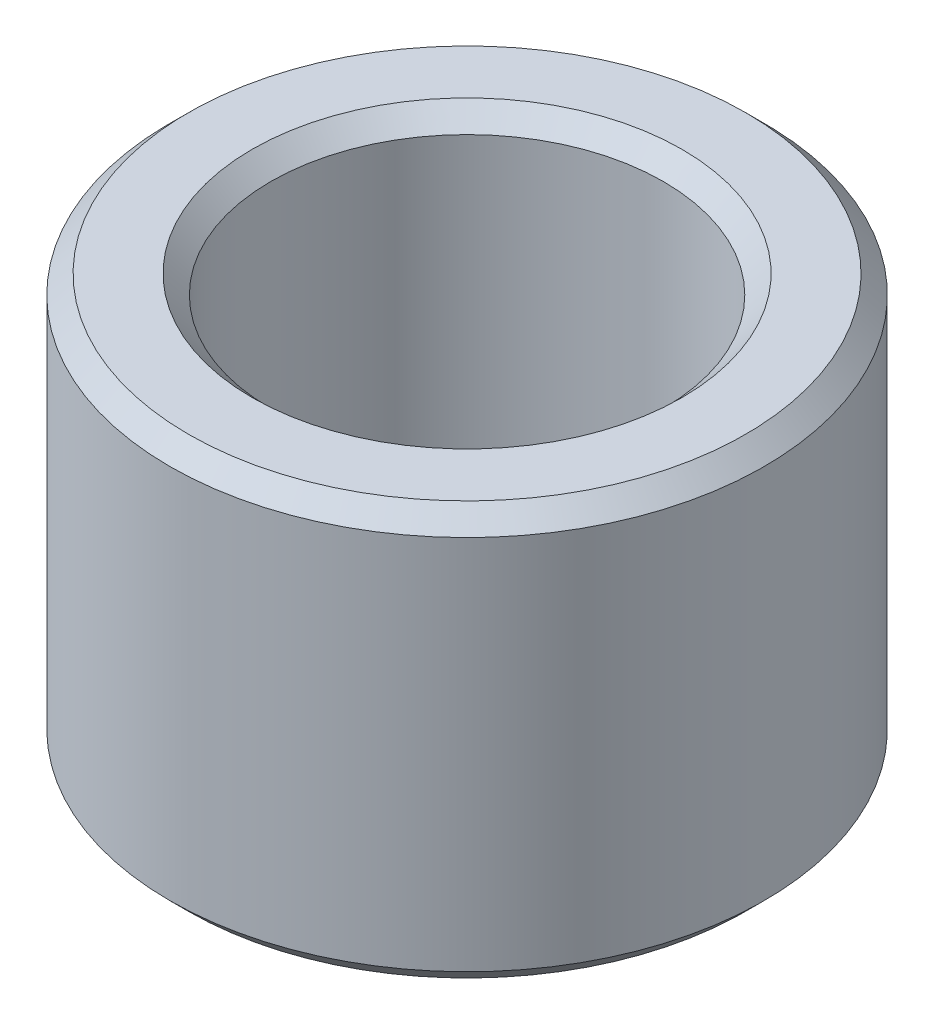
ISO-10303-21;
HEADER;
FILE_DESCRIPTION(('STEP AP214'),'2;1');
FILE_NAME('part.step','',(''),(''),'','','');
FILE_SCHEMA(('AUTOMOTIVE_DESIGN { 1 0 10303 214 1 1 1 1 }'));
ENDSEC;
DATA;
#1=APPLICATION_CONTEXT('core data for automotive mechanical design processes');
#2=APPLICATION_PROTOCOL_DEFINITION('international standard','automotive_design',2000,#1);
#3=PRODUCT_CONTEXT('',#1,'mechanical');
#4=PRODUCT('Part','Part','',(#3));
#5=PRODUCT_RELATED_PRODUCT_CATEGORY('part','',(#4));
#6=PRODUCT_DEFINITION_FORMATION('','',#4);
#7=PRODUCT_DEFINITION_CONTEXT('part definition',#1,'design');
#8=PRODUCT_DEFINITION('design','',#6,#7);
#9=PRODUCT_DEFINITION_SHAPE('','',#8);
#10=(LENGTH_UNIT() NAMED_UNIT(*) SI_UNIT(.MILLI.,.METRE.));
#11=(NAMED_UNIT(*) PLANE_ANGLE_UNIT() SI_UNIT($,.RADIAN.));
#12=(NAMED_UNIT(*) SI_UNIT($,.STERADIAN.) SOLID_ANGLE_UNIT());
#13=UNCERTAINTY_MEASURE_WITH_UNIT(LENGTH_MEASURE(1.E-05),#10,'distance_accuracy_value','');
#14=(GEOMETRIC_REPRESENTATION_CONTEXT(3) GLOBAL_UNCERTAINTY_ASSIGNED_CONTEXT((#13)) GLOBAL_UNIT_ASSIGNED_CONTEXT((#10,
#11,#12)) REPRESENTATION_CONTEXT('',''));
#15=CARTESIAN_POINT('',(0.,0.,0.));
#16=DIRECTION('',(0.,0.,1.));
#17=DIRECTION('',(1.,0.,0.));
#18=AXIS2_PLACEMENT_3D('',#15,#16,#17);
#19=CARTESIAN_POINT('',(0.,55.6094221995827,0.));
#20=DIRECTION('',(0.,-1.,0.));
#21=DIRECTION('',(0.,0.,-1.));
#22=AXIS2_PLACEMENT_3D('',#19,#20,#21);
#23=CYLINDRICAL_SURFACE('',#22,40.);
#24=CARTESIAN_POINT('',(0.,2.50273827667381,0.));
#25=DIRECTION('',(0.,1.,0.));
#26=DIRECTION('',(0.,0.,1.));
#27=AXIS2_PLACEMENT_3D('',#24,#25,#26);
#28=CIRCLE('',#27,40.);
#29=CARTESIAN_POINT('',(0.,2.50273827667381,40.));
#30=VERTEX_POINT('',#29);
#31=EDGE_CURVE('E10',#30,#30,#28,.T.);
#32=ORIENTED_EDGE('',*,*,#31,.T.);
#33=EDGE_LOOP('',(#32));
#34=FACE_BOUND('',#33,.T.);
#35=CARTESIAN_POINT('',(0.,53.1066839229089,0.));
#36=DIRECTION('',(0.,1.,0.));
#37=DIRECTION('',(0.,0.,1.));
#38=AXIS2_PLACEMENT_3D('',#35,#36,#37);
#39=CIRCLE('',#38,40.);
#40=CARTESIAN_POINT('',(0.,53.1066839229089,40.));
#41=VERTEX_POINT('',#40);
#42=EDGE_CURVE('E50',#41,#41,#39,.F.);
#43=ORIENTED_EDGE('',*,*,#42,.T.);
#44=EDGE_LOOP('',(#43));
#45=FACE_BOUND('',#44,.T.);
#46=ADVANCED_FACE('F39',(#34,#45),#23,.T.);
#47=CARTESIAN_POINT('',(0.,55.6094221995827,0.));
#48=DIRECTION('',(0.,1.,0.));
#49=DIRECTION('',(0.,0.,1.));
#50=AXIS2_PLACEMENT_3D('',#47,#48,#49);
#51=PLANE('',#50);
#52=CARTESIAN_POINT('',(0.,55.6094221995827,0.));
#53=DIRECTION('',(0.,1.,0.));
#54=DIRECTION('',(0.,0.,1.));
#55=AXIS2_PLACEMENT_3D('',#52,#53,#54);
#56=CIRCLE('',#55,28.9345783346075);
#57=CARTESIAN_POINT('',(0.,55.6094221995827,28.9345783346075));
#58=VERTEX_POINT('',#57);
#59=EDGE_CURVE('E58',#58,#58,#56,.F.);
#60=ORIENTED_EDGE('',*,*,#59,.T.);
#61=EDGE_LOOP('',(#60));
#62=FACE_BOUND('',#61,.T.);
#63=CARTESIAN_POINT('',(0.,55.6094221995827,0.));
#64=DIRECTION('',(0.,1.,0.));
#65=DIRECTION('',(0.,0.,1.));
#66=AXIS2_PLACEMENT_3D('',#63,#64,#65);
#67=CIRCLE('',#66,37.4972617233262);
#68=CARTESIAN_POINT('',(0.,55.6094221995827,37.4972617233262));
#69=VERTEX_POINT('',#68);
#70=EDGE_CURVE('E61',#69,#69,#67,.T.);
#71=ORIENTED_EDGE('',*,*,#70,.T.);
#72=EDGE_LOOP('',(#71));
#73=FACE_BOUND('',#72,.T.);
#74=ADVANCED_FACE('F88',(#62,#73),#51,.T.);
#75=CARTESIAN_POINT('',(0.,0.,0.));
#76=DIRECTION('',(0.,1.,0.));
#77=DIRECTION('',(0.,0.,1.));
#78=AXIS2_PLACEMENT_3D('',#75,#76,#77);
#79=PLANE('',#78);
#80=CARTESIAN_POINT('',(0.,0.,0.));
#81=DIRECTION('',(0.,1.,0.));
#82=DIRECTION('',(0.,0.,1.));
#83=AXIS2_PLACEMENT_3D('',#80,#81,#82);
#84=CIRCLE('',#83,28.9345783346075);
#85=CARTESIAN_POINT('',(0.,0.,28.9345783346075));
#86=VERTEX_POINT('',#85);
#87=EDGE_CURVE('E51',#86,#86,#84,.T.);
#88=ORIENTED_EDGE('',*,*,#87,.T.);
#89=EDGE_LOOP('',(#88));
#90=FACE_BOUND('',#89,.T.);
#91=CARTESIAN_POINT('',(0.,0.,0.));
#92=DIRECTION('',(0.,1.,0.));
#93=DIRECTION('',(0.,0.,1.));
#94=AXIS2_PLACEMENT_3D('',#91,#92,#93);
#95=CIRCLE('',#94,37.4972617233262);
#96=CARTESIAN_POINT('',(0.,0.,37.4972617233262));
#97=VERTEX_POINT('',#96);
#98=EDGE_CURVE('E54',#97,#97,#95,.F.);
#99=ORIENTED_EDGE('',*,*,#98,.T.);
#100=EDGE_LOOP('',(#99));
#101=FACE_BOUND('',#100,.T.);
#102=ADVANCED_FACE('F83',(#90,#101),#79,.F.);
#103=CARTESIAN_POINT('',(0.,55.6094221995827,0.));
#104=DIRECTION('',(0.,-1.,0.));
#105=DIRECTION('',(0.,0.,-1.));
#106=AXIS2_PLACEMENT_3D('',#103,#104,#105);
#107=CYLINDRICAL_SURFACE('',#106,26.4318400579337);
#108=CARTESIAN_POINT('',(0.,53.1066839229089,0.));
#109=DIRECTION('',(0.,1.,0.));
#110=DIRECTION('',(0.,0.,1.));
#111=AXIS2_PLACEMENT_3D('',#108,#109,#110);
#112=CIRCLE('',#111,26.4318400579337);
#113=CARTESIAN_POINT('',(0.,53.1066839229089,26.4318400579337));
#114=VERTEX_POINT('',#113);
#115=EDGE_CURVE('E67',#114,#114,#112,.T.);
#116=ORIENTED_EDGE('',*,*,#115,.T.);
#117=EDGE_LOOP('',(#116));
#118=FACE_BOUND('',#117,.T.);
#119=CARTESIAN_POINT('',(0.,2.50273827667379,0.));
#120=DIRECTION('',(0.,1.,0.));
#121=DIRECTION('',(0.,0.,1.));
#122=AXIS2_PLACEMENT_3D('',#119,#120,#121);
#123=CIRCLE('',#122,26.4318400579337);
#124=CARTESIAN_POINT('',(0.,2.50273827667379,26.4318400579337));
#125=VERTEX_POINT('',#124);
#126=EDGE_CURVE('E69',#125,#125,#123,.F.);
#127=ORIENTED_EDGE('',*,*,#126,.T.);
#128=EDGE_LOOP('',(#127));
#129=FACE_BOUND('',#128,.T.);
#130=ADVANCED_FACE('F71',(#118,#129),#107,.F.);
#131=CARTESIAN_POINT('',(0.,53.1066839229089,0.));
#132=DIRECTION('',(0.,1.,0.));
#133=DIRECTION('',(0.,0.,1.));
#134=AXIS2_PLACEMENT_3D('',#131,#132,#133);
#135=CONICAL_SURFACE('',#134,26.4318400579337,0.785398163397452);
#136=ORIENTED_EDGE('',*,*,#59,.F.);
#137=EDGE_LOOP('',(#136));
#138=FACE_BOUND('',#137,.T.);
#139=ORIENTED_EDGE('',*,*,#115,.F.);
#140=EDGE_LOOP('',(#139));
#141=FACE_BOUND('',#140,.T.);
#142=ADVANCED_FACE('F77',(#138,#141),#135,.F.);
#143=CARTESIAN_POINT('',(0.,0.,0.));
#144=DIRECTION('',(0.,-1.,0.));
#145=DIRECTION('',(0.,0.,-1.));
#146=AXIS2_PLACEMENT_3D('',#143,#144,#145);
#147=CONICAL_SURFACE('',#146,28.9345783346075,0.785398163397446);
#148=ORIENTED_EDGE('',*,*,#126,.F.);
#149=EDGE_LOOP('',(#148));
#150=FACE_BOUND('',#149,.T.);
#151=ORIENTED_EDGE('',*,*,#87,.F.);
#152=EDGE_LOOP('',(#151));
#153=FACE_BOUND('',#152,.T.);
#154=ADVANCED_FACE('F73',(#150,#153),#147,.F.);
#155=CARTESIAN_POINT('',(0.,2.50273827667381,0.));
#156=DIRECTION('',(0.,1.,0.));
#157=DIRECTION('',(0.,0.,1.));
#158=AXIS2_PLACEMENT_3D('',#155,#156,#157);
#159=CONICAL_SURFACE('',#158,40.,0.785398163397452);
#160=ORIENTED_EDGE('',*,*,#98,.F.);
#161=EDGE_LOOP('',(#160));
#162=FACE_BOUND('',#161,.T.);
#163=ORIENTED_EDGE('',*,*,#31,.F.);
#164=EDGE_LOOP('',(#163));
#165=FACE_BOUND('',#164,.T.);
#166=ADVANCED_FACE('F76',(#162,#165),#159,.T.);
#167=CARTESIAN_POINT('',(0.,55.6094221995827,0.));
#168=DIRECTION('',(0.,-1.,0.));
#169=DIRECTION('',(0.,0.,-1.));
#170=AXIS2_PLACEMENT_3D('',#167,#168,#169);
#171=CONICAL_SURFACE('',#170,37.4972617233262,0.785398163397446);
#172=ORIENTED_EDGE('',*,*,#42,.F.);
#173=EDGE_LOOP('',(#172));
#174=FACE_BOUND('',#173,.T.);
#175=ORIENTED_EDGE('',*,*,#70,.F.);
#176=EDGE_LOOP('',(#175));
#177=FACE_BOUND('',#176,.T.);
#178=ADVANCED_FACE('F45',(#174,#177),#171,.T.);
#179=CLOSED_SHELL('',(#46,#74,#102,#130,#142,#154,#166,#178));
#180=MANIFOLD_SOLID_BREP('B2',#179);
#181=ADVANCED_BREP_SHAPE_REPRESENTATION('',(#18,#180),#14);
#182=SHAPE_DEFINITION_REPRESENTATION(#9,#181);
ENDSEC;
END-ISO-10303-21;
